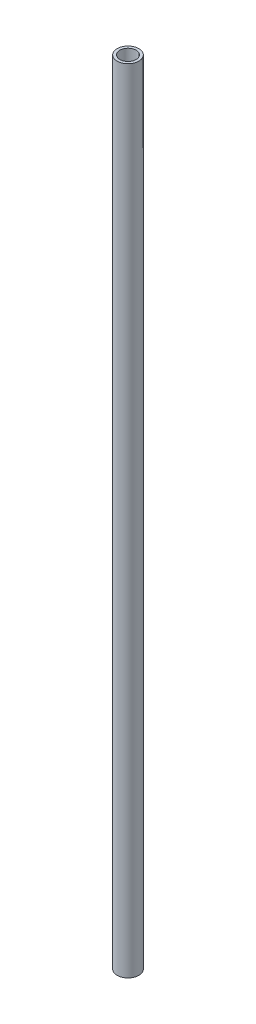
ISO-10303-21;
HEADER;
FILE_DESCRIPTION(('STEP AP214'),'2;1');
FILE_NAME('part.step','',(''),(''),'','','');
FILE_SCHEMA(('AUTOMOTIVE_DESIGN { 1 0 10303 214 1 1 1 1 }'));
ENDSEC;
DATA;
#1=APPLICATION_CONTEXT('core data for automotive mechanical design processes');
#2=APPLICATION_PROTOCOL_DEFINITION('international standard','automotive_design',2000,#1);
#3=PRODUCT_CONTEXT('',#1,'mechanical');
#4=PRODUCT('Part','Part','',(#3));
#5=PRODUCT_RELATED_PRODUCT_CATEGORY('part','',(#4));
#6=PRODUCT_DEFINITION_FORMATION('','',#4);
#7=PRODUCT_DEFINITION_CONTEXT('part definition',#1,'design');
#8=PRODUCT_DEFINITION('design','',#6,#7);
#9=PRODUCT_DEFINITION_SHAPE('','',#8);
#10=(LENGTH_UNIT() NAMED_UNIT(*) SI_UNIT(.MILLI.,.METRE.));
#11=(NAMED_UNIT(*) PLANE_ANGLE_UNIT() SI_UNIT($,.RADIAN.));
#12=(NAMED_UNIT(*) SI_UNIT($,.STERADIAN.) SOLID_ANGLE_UNIT());
#13=UNCERTAINTY_MEASURE_WITH_UNIT(LENGTH_MEASURE(1.E-05),#10,'distance_accuracy_value','');
#14=(GEOMETRIC_REPRESENTATION_CONTEXT(3) GLOBAL_UNCERTAINTY_ASSIGNED_CONTEXT((#13)) GLOBAL_UNIT_ASSIGNED_CONTEXT((#10,
#11,#12)) REPRESENTATION_CONTEXT('',''));
#15=CARTESIAN_POINT('',(0.,0.,0.));
#16=DIRECTION('',(0.,0.,1.));
#17=DIRECTION('',(1.,0.,0.));
#18=AXIS2_PLACEMENT_3D('',#15,#16,#17);
#19=CARTESIAN_POINT('',(0.,463.55,0.));
#20=DIRECTION('',(0.,1.,0.));
#21=DIRECTION('',(0.,0.,1.));
#22=AXIS2_PLACEMENT_3D('',#19,#20,#21);
#23=PLANE('',#22);
#24=CARTESIAN_POINT('',(0.,463.55,0.));
#25=DIRECTION('',(0.,1.,0.));
#26=DIRECTION('',(0.,0.,1.));
#27=AXIS2_PLACEMENT_3D('',#24,#25,#26);
#28=CIRCLE('',#27,12.7);
#29=CARTESIAN_POINT('',(0.,463.55,12.7));
#30=VERTEX_POINT('',#29);
#31=EDGE_CURVE('E10',#30,#30,#28,.T.);
#32=ORIENTED_EDGE('',*,*,#31,.T.);
#33=EDGE_LOOP('',(#32));
#34=FACE_BOUND('',#33,.T.);
#35=CARTESIAN_POINT('',(0.,463.55,0.));
#36=DIRECTION('',(0.,1.,0.));
#37=DIRECTION('',(0.,0.,1.));
#38=AXIS2_PLACEMENT_3D('',#35,#36,#37);
#39=CIRCLE('',#38,9.52500000000001);
#40=CARTESIAN_POINT('',(0.,463.55,9.52500000000001));
#41=VERTEX_POINT('',#40);
#42=EDGE_CURVE('E47',#41,#41,#39,.T.);
#43=ORIENTED_EDGE('',*,*,#42,.F.);
#44=EDGE_LOOP('',(#43));
#45=FACE_BOUND('',#44,.T.);
#46=ADVANCED_FACE('F36',(#34,#45),#23,.T.);
#47=CARTESIAN_POINT('',(0.,-463.55,0.));
#48=DIRECTION('',(0.,1.,0.));
#49=DIRECTION('',(0.,0.,1.));
#50=AXIS2_PLACEMENT_3D('',#47,#48,#49);
#51=PLANE('',#50);
#52=CARTESIAN_POINT('',(0.,-463.55,0.));
#53=DIRECTION('',(0.,1.,0.));
#54=DIRECTION('',(0.,0.,1.));
#55=AXIS2_PLACEMENT_3D('',#52,#53,#54);
#56=CIRCLE('',#55,12.7);
#57=CARTESIAN_POINT('',(0.,-463.55,12.7));
#58=VERTEX_POINT('',#57);
#59=EDGE_CURVE('E40',#58,#58,#56,.T.);
#60=ORIENTED_EDGE('',*,*,#59,.F.);
#61=EDGE_LOOP('',(#60));
#62=FACE_BOUND('',#61,.T.);
#63=CARTESIAN_POINT('',(0.,-463.55,0.));
#64=DIRECTION('',(0.,1.,0.));
#65=DIRECTION('',(0.,0.,1.));
#66=AXIS2_PLACEMENT_3D('',#63,#64,#65);
#67=CIRCLE('',#66,9.52500000000001);
#68=CARTESIAN_POINT('',(0.,-463.55,9.52500000000001));
#69=VERTEX_POINT('',#68);
#70=EDGE_CURVE('E49',#69,#69,#67,.T.);
#71=ORIENTED_EDGE('',*,*,#70,.T.);
#72=EDGE_LOOP('',(#71));
#73=FACE_BOUND('',#72,.T.);
#74=ADVANCED_FACE('F59',(#62,#73),#51,.F.);
#75=CARTESIAN_POINT('',(0.,463.55,0.));
#76=DIRECTION('',(0.,-1.,0.));
#77=DIRECTION('',(0.,0.,-1.));
#78=AXIS2_PLACEMENT_3D('',#75,#76,#77);
#79=CYLINDRICAL_SURFACE('',#78,12.7);
#80=ORIENTED_EDGE('',*,*,#31,.F.);
#81=EDGE_LOOP('',(#80));
#82=FACE_BOUND('',#81,.T.);
#83=ORIENTED_EDGE('',*,*,#59,.T.);
#84=EDGE_LOOP('',(#83));
#85=FACE_BOUND('',#84,.T.);
#86=ADVANCED_FACE('F38',(#82,#85),#79,.T.);
#87=CARTESIAN_POINT('',(0.,463.55,0.));
#88=DIRECTION('',(0.,-1.,0.));
#89=DIRECTION('',(0.,0.,-1.));
#90=AXIS2_PLACEMENT_3D('',#87,#88,#89);
#91=CYLINDRICAL_SURFACE('',#90,9.52500000000001);
#92=ORIENTED_EDGE('',*,*,#42,.T.);
#93=EDGE_LOOP('',(#92));
#94=FACE_BOUND('',#93,.T.);
#95=ORIENTED_EDGE('',*,*,#70,.F.);
#96=EDGE_LOOP('',(#95));
#97=FACE_BOUND('',#96,.T.);
#98=ADVANCED_FACE('F55',(#94,#97),#91,.F.);
#99=CLOSED_SHELL('',(#46,#74,#86,#98));
#100=MANIFOLD_SOLID_BREP('B2',#99);
#101=ADVANCED_BREP_SHAPE_REPRESENTATION('',(#18,#100),#14);
#102=SHAPE_DEFINITION_REPRESENTATION(#9,#101);
ENDSEC;
END-ISO-10303-21;
